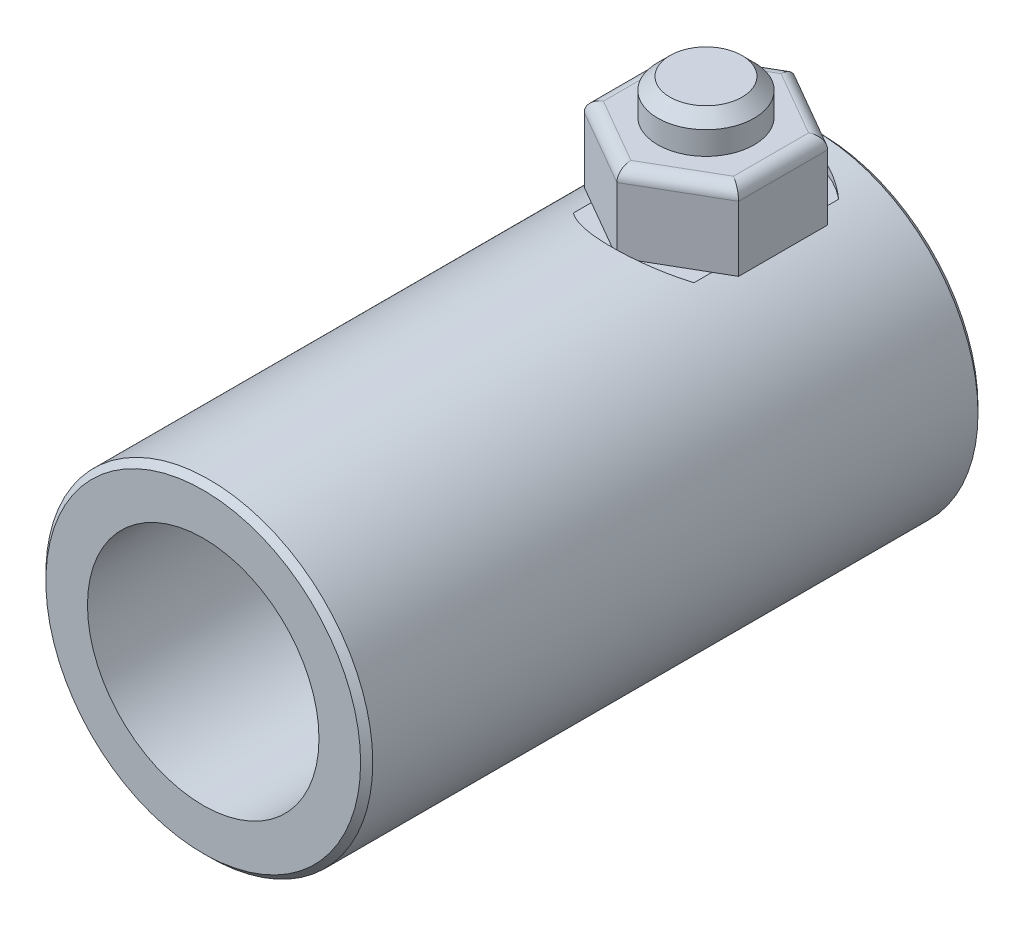
ISO-10303-21;
HEADER;
FILE_DESCRIPTION(('STEP AP214'),'2;1');
FILE_NAME('part.step','',(''),(''),'','','');
FILE_SCHEMA(('AUTOMOTIVE_DESIGN { 1 0 10303 214 1 1 1 1 }'));
ENDSEC;
DATA;
#1=APPLICATION_CONTEXT('core data for automotive mechanical design processes');
#2=APPLICATION_PROTOCOL_DEFINITION('international standard','automotive_design',2000,#1);
#3=PRODUCT_CONTEXT('',#1,'mechanical');
#4=PRODUCT('Part','Part','',(#3));
#5=PRODUCT_RELATED_PRODUCT_CATEGORY('part','',(#4));
#6=PRODUCT_DEFINITION_FORMATION('','',#4);
#7=PRODUCT_DEFINITION_CONTEXT('part definition',#1,'design');
#8=PRODUCT_DEFINITION('design','',#6,#7);
#9=PRODUCT_DEFINITION_SHAPE('','',#8);
#10=(LENGTH_UNIT() NAMED_UNIT(*) SI_UNIT(.MILLI.,.METRE.));
#11=(NAMED_UNIT(*) PLANE_ANGLE_UNIT() SI_UNIT($,.RADIAN.));
#12=(NAMED_UNIT(*) SI_UNIT($,.STERADIAN.) SOLID_ANGLE_UNIT());
#13=UNCERTAINTY_MEASURE_WITH_UNIT(LENGTH_MEASURE(1.E-05),#10,'distance_accuracy_value','');
#14=(GEOMETRIC_REPRESENTATION_CONTEXT(3) GLOBAL_UNCERTAINTY_ASSIGNED_CONTEXT((#13)) GLOBAL_UNIT_ASSIGNED_CONTEXT((#10,
#11,#12)) REPRESENTATION_CONTEXT('',''));
#15=CARTESIAN_POINT('',(0.,0.,0.));
#16=DIRECTION('',(0.,0.,1.));
#17=DIRECTION('',(1.,0.,0.));
#18=AXIS2_PLACEMENT_3D('',#15,#16,#17);
#19=CARTESIAN_POINT('',(0.,18.85,-8.63640158129175));
#20=DIRECTION('',(-0.5,0.,-0.866025403784439));
#21=DIRECTION('',(-0.866025403784439,0.,0.5));
#22=AXIS2_PLACEMENT_3D('',#19,#20,#21);
#23=PLANE('',#22);
#24=DIRECTION('',(0.,-1.,0.));
#25=VECTOR('',#24,1.);
#26=CARTESIAN_POINT('',(6.35,18.85,-12.3025757906459));
#27=LINE('',#26,#25);
#28=CARTESIAN_POINT('',(6.35,17.85,-12.3025757906459));
#29=VERTEX_POINT('',#28);
#30=CARTESIAN_POINT('',(6.35,12.5,-12.3025757906459));
#31=VERTEX_POINT('',#30);
#32=EDGE_CURVE('E114',#29,#31,#27,.T.);
#33=ORIENTED_EDGE('',*,*,#32,.F.);
#34=DIRECTION('',(0.866025403784439,0.,-0.5));
#35=VECTOR('',#34,1.);
#36=CARTESIAN_POINT('',(0.,17.85,-8.63640158129175));
#37=LINE('',#36,#35);
#38=CARTESIAN_POINT('',(0.,17.85,-8.63640158129175));
#39=VERTEX_POINT('',#38);
#40=EDGE_CURVE('E12',#29,#39,#37,.F.);
#41=ORIENTED_EDGE('',*,*,#40,.T.);
#42=DIRECTION('',(0.,-1.,0.));
#43=VECTOR('',#42,1.);
#44=CARTESIAN_POINT('',(0.,18.85,-8.63640158129175));
#45=LINE('',#44,#43);
#46=CARTESIAN_POINT('',(0.,12.5,-8.63640158129175));
#47=VERTEX_POINT('',#46);
#48=EDGE_CURVE('E135',#39,#47,#45,.T.);
#49=ORIENTED_EDGE('',*,*,#48,.T.);
#50=DIRECTION('',(0.866025403784439,0.,-0.5));
#51=VECTOR('',#50,1.);
#52=CARTESIAN_POINT('',(0.,12.5,-8.63640158129175));
#53=LINE('',#52,#51);
#54=EDGE_CURVE('E129',#47,#31,#53,.T.);
#55=ORIENTED_EDGE('',*,*,#54,.T.);
#56=EDGE_LOOP('',(#33,#41,#49,#55));
#57=FACE_BOUND('',#56,.T.);
#58=ADVANCED_FACE('F44',(#57),#23,.F.);
#59=CARTESIAN_POINT('',(6.35,18.85,-12.3025757906459));
#60=DIRECTION('',(-1.,0.,0.));
#61=DIRECTION('',(0.,0.,1.));
#62=AXIS2_PLACEMENT_3D('',#59,#60,#61);
#63=PLANE('',#62);
#64=DIRECTION('',(0.,-1.,0.));
#65=VECTOR('',#64,1.);
#66=CARTESIAN_POINT('',(6.35,18.85,-19.6349242093541));
#67=LINE('',#66,#65);
#68=CARTESIAN_POINT('',(6.35,17.85,-19.6349242093541));
#69=VERTEX_POINT('',#68);
#70=CARTESIAN_POINT('',(6.35,12.5,-19.6349242093541));
#71=VERTEX_POINT('',#70);
#72=EDGE_CURVE('E123',#69,#71,#67,.T.);
#73=ORIENTED_EDGE('',*,*,#72,.F.);
#74=DIRECTION('',(0.,0.,-1.));
#75=VECTOR('',#74,1.);
#76=CARTESIAN_POINT('',(6.35,17.85,-12.3025757906459));
#77=LINE('',#76,#75);
#78=EDGE_CURVE('E53',#69,#29,#77,.F.);
#79=ORIENTED_EDGE('',*,*,#78,.T.);
#80=ORIENTED_EDGE('',*,*,#32,.T.);
#81=DIRECTION('',(0.,0.,-1.));
#82=VECTOR('',#81,1.);
#83=CARTESIAN_POINT('',(6.35,12.5,-12.3025757906459));
#84=LINE('',#83,#82);
#85=EDGE_CURVE('E117',#31,#71,#84,.T.);
#86=ORIENTED_EDGE('',*,*,#85,.T.);
#87=EDGE_LOOP('',(#73,#79,#80,#86));
#88=FACE_BOUND('',#87,.T.);
#89=ADVANCED_FACE('F116',(#88),#63,.F.);
#90=CARTESIAN_POINT('',(6.35,18.85,-19.6349242093541));
#91=DIRECTION('',(-0.5,0.,0.866025403784438));
#92=DIRECTION('',(0.866025403784438,0.,0.500000000000001));
#93=AXIS2_PLACEMENT_3D('',#90,#91,#92);
#94=PLANE('',#93);
#95=DIRECTION('',(0.,-1.,0.));
#96=VECTOR('',#95,1.);
#97=CARTESIAN_POINT('',(0.,18.85,-23.3010984187082));
#98=LINE('',#97,#96);
#99=CARTESIAN_POINT('',(0.,17.85,-23.3010984187082));
#100=VERTEX_POINT('',#99);
#101=CARTESIAN_POINT('',(0.,12.5,-23.3010984187082));
#102=VERTEX_POINT('',#101);
#103=EDGE_CURVE('E155',#100,#102,#98,.T.);
#104=ORIENTED_EDGE('',*,*,#103,.F.);
#105=DIRECTION('',(-0.866025403784438,0.,-0.500000000000001));
#106=VECTOR('',#105,1.);
#107=CARTESIAN_POINT('',(6.35,17.85,-19.6349242093541));
#108=LINE('',#107,#106);
#109=EDGE_CURVE('E68',#100,#69,#108,.F.);
#110=ORIENTED_EDGE('',*,*,#109,.T.);
#111=ORIENTED_EDGE('',*,*,#72,.T.);
#112=DIRECTION('',(-0.866025403784438,0.,-0.500000000000001));
#113=VECTOR('',#112,1.);
#114=CARTESIAN_POINT('',(6.35,12.5,-19.6349242093541));
#115=LINE('',#114,#113);
#116=EDGE_CURVE('E132',#71,#102,#115,.T.);
#117=ORIENTED_EDGE('',*,*,#116,.T.);
#118=EDGE_LOOP('',(#104,#110,#111,#117));
#119=FACE_BOUND('',#118,.T.);
#120=ADVANCED_FACE('F237',(#119),#94,.F.);
#121=CARTESIAN_POINT('',(0.,18.85,-23.3010984187082));
#122=DIRECTION('',(0.5,0.,0.866025403784439));
#123=DIRECTION('',(0.866025403784439,0.,-0.5));
#124=AXIS2_PLACEMENT_3D('',#121,#122,#123);
#125=PLANE('',#124);
#126=DIRECTION('',(0.,-1.,0.));
#127=VECTOR('',#126,1.);
#128=CARTESIAN_POINT('',(-6.35,18.85,-19.6349242093541));
#129=LINE('',#128,#127);
#130=CARTESIAN_POINT('',(-6.35,17.85,-19.6349242093541));
#131=VERTEX_POINT('',#130);
#132=CARTESIAN_POINT('',(-6.35,12.5,-19.6349242093541));
#133=VERTEX_POINT('',#132);
#134=EDGE_CURVE('E153',#131,#133,#129,.T.);
#135=ORIENTED_EDGE('',*,*,#134,.F.);
#136=DIRECTION('',(-0.866025403784439,0.,0.5));
#137=VECTOR('',#136,1.);
#138=CARTESIAN_POINT('',(0.,17.85,-23.3010984187082));
#139=LINE('',#138,#137);
#140=EDGE_CURVE('E175',#131,#100,#139,.F.);
#141=ORIENTED_EDGE('',*,*,#140,.T.);
#142=ORIENTED_EDGE('',*,*,#103,.T.);
#143=DIRECTION('',(-0.866025403784439,0.,0.5));
#144=VECTOR('',#143,1.);
#145=CARTESIAN_POINT('',(0.,12.5,-23.3010984187082));
#146=LINE('',#145,#144);
#147=EDGE_CURVE('E142',#102,#133,#146,.T.);
#148=ORIENTED_EDGE('',*,*,#147,.T.);
#149=EDGE_LOOP('',(#135,#141,#142,#148));
#150=FACE_BOUND('',#149,.T.);
#151=ADVANCED_FACE('F222',(#150),#125,.F.);
#152=CARTESIAN_POINT('',(-6.35,18.85,-19.6349242093541));
#153=DIRECTION('',(1.,0.,0.));
#154=DIRECTION('',(0.,0.,-1.));
#155=AXIS2_PLACEMENT_3D('',#152,#153,#154);
#156=PLANE('',#155);
#157=DIRECTION('',(0.,-1.,0.));
#158=VECTOR('',#157,1.);
#159=CARTESIAN_POINT('',(-6.35,18.85,-12.3025757906459));
#160=LINE('',#159,#158);
#161=CARTESIAN_POINT('',(-6.35,17.85,-12.3025757906459));
#162=VERTEX_POINT('',#161);
#163=CARTESIAN_POINT('',(-6.35,12.5,-12.3025757906459));
#164=VERTEX_POINT('',#163);
#165=EDGE_CURVE('E151',#162,#164,#160,.T.);
#166=ORIENTED_EDGE('',*,*,#165,.F.);
#167=DIRECTION('',(0.,0.,1.));
#168=VECTOR('',#167,1.);
#169=CARTESIAN_POINT('',(-6.35,17.85,-19.6349242093541));
#170=LINE('',#169,#168);
#171=EDGE_CURVE('E173',#162,#131,#170,.F.);
#172=ORIENTED_EDGE('',*,*,#171,.T.);
#173=ORIENTED_EDGE('',*,*,#134,.T.);
#174=DIRECTION('',(0.,0.,1.));
#175=VECTOR('',#174,1.);
#176=CARTESIAN_POINT('',(-6.35,12.5,-19.6349242093541));
#177=LINE('',#176,#175);
#178=EDGE_CURVE('E145',#133,#164,#177,.T.);
#179=ORIENTED_EDGE('',*,*,#178,.T.);
#180=EDGE_LOOP('',(#166,#172,#173,#179));
#181=FACE_BOUND('',#180,.T.);
#182=ADVANCED_FACE('F219',(#181),#156,.F.);
#183=CARTESIAN_POINT('',(-6.35,18.85,-12.3025757906459));
#184=DIRECTION('',(0.5,0.,-0.866025403784438));
#185=DIRECTION('',(-0.866025403784439,0.,-0.5));
#186=AXIS2_PLACEMENT_3D('',#183,#184,#185);
#187=PLANE('',#186);
#188=ORIENTED_EDGE('',*,*,#48,.F.);
#189=DIRECTION('',(0.866025403784439,0.,0.5));
#190=VECTOR('',#189,1.);
#191=CARTESIAN_POINT('',(-6.35,17.85,-12.3025757906459));
#192=LINE('',#191,#190);
#193=EDGE_CURVE('E170',#39,#162,#192,.F.);
#194=ORIENTED_EDGE('',*,*,#193,.T.);
#195=ORIENTED_EDGE('',*,*,#165,.T.);
#196=DIRECTION('',(0.866025403784439,0.,0.5));
#197=VECTOR('',#196,1.);
#198=CARTESIAN_POINT('',(-6.35,12.5,-12.3025757906459));
#199=LINE('',#198,#197);
#200=EDGE_CURVE('E148',#164,#47,#199,.T.);
#201=ORIENTED_EDGE('',*,*,#200,.T.);
#202=EDGE_LOOP('',(#188,#194,#195,#201));
#203=FACE_BOUND('',#202,.T.);
#204=ADVANCED_FACE('F208',(#203),#187,.F.);
#205=CARTESIAN_POINT('',(0.,18.85,0.));
#206=DIRECTION('',(0.,1.,0.));
#207=DIRECTION('',(0.,0.,1.));
#208=AXIS2_PLACEMENT_3D('',#205,#206,#207);
#209=PLANE('',#208);
#210=DIRECTION('',(0.,0.,1.));
#211=VECTOR('',#210,1.);
#212=CARTESIAN_POINT('',(-5.35,18.85,-12.3025757906459));
#213=LINE('',#212,#211);
#214=CARTESIAN_POINT('',(-5.35,18.85,-19.0575739401645));
#215=VERTEX_POINT('',#214);
#216=CARTESIAN_POINT('',(-5.35,18.85,-12.8799260598355));
#217=VERTEX_POINT('',#216);
#218=EDGE_CURVE('E165',#215,#217,#213,.T.);
#219=ORIENTED_EDGE('',*,*,#218,.T.);
#220=DIRECTION('',(0.866025403784439,0.,0.5));
#221=VECTOR('',#220,1.);
#222=CARTESIAN_POINT('',(0.499999999999994,18.85,-9.50242698507619));
#223=LINE('',#222,#221);
#224=CARTESIAN_POINT('',(0.,18.85,-9.791102119671));
#225=VERTEX_POINT('',#224);
#226=EDGE_CURVE('E167',#217,#225,#223,.T.);
#227=ORIENTED_EDGE('',*,*,#226,.T.);
#228=DIRECTION('',(0.866025403784439,0.,-0.5));
#229=VECTOR('',#228,1.);
#230=CARTESIAN_POINT('',(5.85,18.85,-13.1686011944303));
#231=LINE('',#230,#229);
#232=CARTESIAN_POINT('',(5.35,18.85,-12.8799260598355));
#233=VERTEX_POINT('',#232);
#234=EDGE_CURVE('E122',#225,#233,#231,.T.);
#235=ORIENTED_EDGE('',*,*,#234,.T.);
#236=DIRECTION('',(0.,0.,-1.));
#237=VECTOR('',#236,1.);
#238=CARTESIAN_POINT('',(5.35,18.85,-19.6349242093541));
#239=LINE('',#238,#237);
#240=CARTESIAN_POINT('',(5.35,18.85,-19.0575739401645));
#241=VERTEX_POINT('',#240);
#242=EDGE_CURVE('E159',#233,#241,#239,.T.);
#243=ORIENTED_EDGE('',*,*,#242,.T.);
#244=DIRECTION('',(-0.866025403784438,0.,-0.500000000000001));
#245=VECTOR('',#244,1.);
#246=CARTESIAN_POINT('',(-0.500000000000004,18.85,-22.4350730149238));
#247=LINE('',#246,#245);
#248=CARTESIAN_POINT('',(0.,18.85,-22.146397880329));
#249=VERTEX_POINT('',#248);
#250=EDGE_CURVE('E161',#241,#249,#247,.T.);
#251=ORIENTED_EDGE('',*,*,#250,.T.);
#252=DIRECTION('',(-0.866025403784439,0.,0.5));
#253=VECTOR('',#252,1.);
#254=CARTESIAN_POINT('',(-5.85,18.85,-18.7688988055697));
#255=LINE('',#254,#253);
#256=EDGE_CURVE('E163',#249,#215,#255,.T.);
#257=ORIENTED_EDGE('',*,*,#256,.T.);
#258=EDGE_LOOP('',(#219,#227,#235,#243,#251,#257));
#259=FACE_BOUND('',#258,.T.);
#260=ADVANCED_FACE('F198',(#259),#209,.T.);
#261=CARTESIAN_POINT('',(0.,12.5,0.));
#262=DIRECTION('',(0.,1.,0.));
#263=DIRECTION('',(0.,0.,1.));
#264=AXIS2_PLACEMENT_3D('',#261,#262,#263);
#265=PLANE('',#264);
#266=ORIENTED_EDGE('',*,*,#54,.F.);
#267=ORIENTED_EDGE('',*,*,#200,.F.);
#268=ORIENTED_EDGE('',*,*,#178,.F.);
#269=ORIENTED_EDGE('',*,*,#147,.F.);
#270=ORIENTED_EDGE('',*,*,#116,.F.);
#271=ORIENTED_EDGE('',*,*,#85,.F.);
#272=EDGE_LOOP('',(#266,#267,#268,#269,#270,#271));
#273=FACE_BOUND('',#272,.T.);
#274=ADVANCED_FACE('F127',(#273),#265,.F.);
#275=CARTESIAN_POINT('',(9.58967158334138,17.85,-16.6097984102467));
#276=DIRECTION('',(0.866025403784438,0.,0.500000000000001));
#277=DIRECTION('',(0.500000000000001,0.,-0.866025403784438));
#278=AXIS2_PLACEMENT_3D('',#275,#276,#277);
#279=CYLINDRICAL_SURFACE('',#278,1.);
#280=CARTESIAN_POINT('',(5.35,17.85,-19.0575739401645));
#281=DIRECTION('',(0.5,0.,0.866025403784439));
#282=DIRECTION('',(-0.866025403784439,0.,0.5));
#283=AXIS2_PLACEMENT_3D('',#280,#281,#282);
#284=ELLIPSE('',#283,1.15470053837925,1.);
#285=EDGE_CURVE('E139',#69,#241,#284,.T.);
#286=ORIENTED_EDGE('',*,*,#285,.F.);
#287=ORIENTED_EDGE('',*,*,#109,.F.);
#288=CARTESIAN_POINT('',(0.,17.85,-22.146397880329));
#289=DIRECTION('',(1.,0.,0.));
#290=DIRECTION('',(0.,0.,1.));
#291=AXIS2_PLACEMENT_3D('',#288,#289,#290);
#292=ELLIPSE('',#291,1.15470053837925,1.);
#293=EDGE_CURVE('E48',#249,#100,#292,.F.);
#294=ORIENTED_EDGE('',*,*,#293,.F.);
#295=ORIENTED_EDGE('',*,*,#250,.F.);
#296=EDGE_LOOP('',(#286,#287,#294,#295));
#297=FACE_BOUND('',#296,.T.);
#298=ADVANCED_FACE('F46',(#297),#279,.T.);
#299=CARTESIAN_POINT('',(-9.58967158334138,17.85,-16.6097984102467));
#300=DIRECTION('',(0.866025403784439,0.,-0.5));
#301=DIRECTION('',(-0.5,0.,-0.866025403784439));
#302=AXIS2_PLACEMENT_3D('',#299,#300,#301);
#303=CYLINDRICAL_SURFACE('',#302,1.);
#304=ORIENTED_EDGE('',*,*,#293,.T.);
#305=ORIENTED_EDGE('',*,*,#140,.F.);
#306=CARTESIAN_POINT('',(-5.35,17.85,-19.0575739401645));
#307=DIRECTION('',(0.5,0.,-0.866025403784439));
#308=DIRECTION('',(0.866025403784439,0.,0.5));
#309=AXIS2_PLACEMENT_3D('',#306,#307,#308);
#310=ELLIPSE('',#309,1.15470053837925,1.);
#311=EDGE_CURVE('E186',#215,#131,#310,.F.);
#312=ORIENTED_EDGE('',*,*,#311,.F.);
#313=ORIENTED_EDGE('',*,*,#256,.F.);
#314=EDGE_LOOP('',(#304,#305,#312,#313));
#315=FACE_BOUND('',#314,.T.);
#316=ADVANCED_FACE('F225',(#315),#303,.T.);
#317=CARTESIAN_POINT('',(5.35,17.85,0.));
#318=DIRECTION('',(0.,0.,1.));
#319=DIRECTION('',(1.,0.,0.));
#320=AXIS2_PLACEMENT_3D('',#317,#318,#319);
#321=CYLINDRICAL_SURFACE('',#320,1.);
#322=ORIENTED_EDGE('',*,*,#285,.T.);
#323=ORIENTED_EDGE('',*,*,#242,.F.);
#324=CARTESIAN_POINT('',(5.35,17.85,-12.8799260598355));
#325=DIRECTION('',(-0.5,0.,0.866025403784439));
#326=DIRECTION('',(-0.866025403784439,0.,-0.5));
#327=AXIS2_PLACEMENT_3D('',#324,#325,#326);
#328=ELLIPSE('',#327,1.15470053837925,1.);
#329=EDGE_CURVE('E183',#29,#233,#328,.T.);
#330=ORIENTED_EDGE('',*,*,#329,.F.);
#331=ORIENTED_EDGE('',*,*,#78,.F.);
#332=EDGE_LOOP('',(#322,#323,#330,#331));
#333=FACE_BOUND('',#332,.T.);
#334=ADVANCED_FACE('F192',(#333),#321,.T.);
#335=CARTESIAN_POINT('',(-5.35,17.85,0.));
#336=DIRECTION('',(0.,0.,-1.));
#337=DIRECTION('',(-1.,0.,0.));
#338=AXIS2_PLACEMENT_3D('',#335,#336,#337);
#339=CYLINDRICAL_SURFACE('',#338,1.);
#340=ORIENTED_EDGE('',*,*,#311,.T.);
#341=ORIENTED_EDGE('',*,*,#171,.F.);
#342=CARTESIAN_POINT('',(-5.35,17.85,-12.8799260598355));
#343=DIRECTION('',(-0.5,0.,-0.866025403784439));
#344=DIRECTION('',(0.866025403784439,0.,-0.5));
#345=AXIS2_PLACEMENT_3D('',#342,#343,#344);
#346=ELLIPSE('',#345,1.15470053837925,1.);
#347=EDGE_CURVE('E181',#217,#162,#346,.F.);
#348=ORIENTED_EDGE('',*,*,#347,.F.);
#349=ORIENTED_EDGE('',*,*,#218,.F.);
#350=EDGE_LOOP('',(#340,#341,#348,#349));
#351=FACE_BOUND('',#350,.T.);
#352=ADVANCED_FACE('F216',(#351),#339,.T.);
#353=CARTESIAN_POINT('',(-4.23967158334137,17.85,-7.34332658975325));
#354=DIRECTION('',(-0.866025403784439,0.,0.5));
#355=DIRECTION('',(0.5,0.,0.866025403784439));
#356=AXIS2_PLACEMENT_3D('',#353,#354,#355);
#357=CYLINDRICAL_SURFACE('',#356,1.);
#358=ORIENTED_EDGE('',*,*,#329,.T.);
#359=ORIENTED_EDGE('',*,*,#234,.F.);
#360=CARTESIAN_POINT('',(0.,17.85,-9.791102119671));
#361=DIRECTION('',(-1.,0.,0.));
#362=DIRECTION('',(0.,0.,1.));
#363=AXIS2_PLACEMENT_3D('',#360,#361,#362);
#364=ELLIPSE('',#363,1.15470053837925,1.);
#365=EDGE_CURVE('E179',#39,#225,#364,.T.);
#366=ORIENTED_EDGE('',*,*,#365,.F.);
#367=ORIENTED_EDGE('',*,*,#40,.F.);
#368=EDGE_LOOP('',(#358,#359,#366,#367));
#369=FACE_BOUND('',#368,.T.);
#370=ADVANCED_FACE('F204',(#369),#357,.T.);
#371=CARTESIAN_POINT('',(4.23967158334137,17.85,-7.34332658975325));
#372=DIRECTION('',(-0.866025403784439,0.,-0.5));
#373=DIRECTION('',(-0.5,0.,0.866025403784439));
#374=AXIS2_PLACEMENT_3D('',#371,#372,#373);
#375=CYLINDRICAL_SURFACE('',#374,1.);
#376=ORIENTED_EDGE('',*,*,#347,.T.);
#377=ORIENTED_EDGE('',*,*,#193,.F.);
#378=ORIENTED_EDGE('',*,*,#365,.T.);
#379=ORIENTED_EDGE('',*,*,#226,.F.);
#380=EDGE_LOOP('',(#376,#377,#378,#379));
#381=FACE_BOUND('',#380,.T.);
#382=ADVANCED_FACE('F211',(#381),#375,.T.);
#383=CLOSED_SHELL('',(#58,#89,#120,#151,#182,#204,#260,#274,#298,#316,#334,#352,#370,#382));
#384=MANIFOLD_SOLID_BREP('B2',#383);
#385=CARTESIAN_POINT('',(0.,0.,-25.4));
#386=DIRECTION('',(0.,0.,1.));
#387=DIRECTION('',(1.,0.,0.));
#388=AXIS2_PLACEMENT_3D('',#385,#386,#387);
#389=CYLINDRICAL_SURFACE('',#388,13.45);
#390=CARTESIAN_POINT('',(0.,0.,-24.9));
#391=DIRECTION('',(0.,0.,1.));
#392=DIRECTION('',(1.,0.,0.));
#393=AXIS2_PLACEMENT_3D('',#390,#391,#392);
#394=CIRCLE('',#393,13.45);
#395=CARTESIAN_POINT('',(13.45,0.,-24.9));
#396=VERTEX_POINT('',#395);
#397=EDGE_CURVE('E464',#396,#396,#394,.T.);
#398=ORIENTED_EDGE('',*,*,#397,.T.);
#399=EDGE_LOOP('',(#398));
#400=FACE_BOUND('',#399,.T.);
#401=CARTESIAN_POINT('',(0.,0.,24.9));
#402=DIRECTION('',(0.,0.,1.));
#403=DIRECTION('',(1.,0.,0.));
#404=AXIS2_PLACEMENT_3D('',#401,#402,#403);
#405=CIRCLE('',#404,13.45);
#406=CARTESIAN_POINT('',(13.45,0.,24.9));
#407=VERTEX_POINT('',#406);
#408=EDGE_CURVE('E467',#407,#407,#405,.F.);
#409=ORIENTED_EDGE('',*,*,#408,.T.);
#410=EDGE_LOOP('',(#409));
#411=FACE_BOUND('',#410,.T.);
#412=DIRECTION('',(0.,0.,1.));
#413=VECTOR('',#412,1.);
#414=CARTESIAN_POINT('',(4.96512839713133,12.5,-25.4));
#415=LINE('',#414,#413);
#416=CARTESIAN_POINT('',(4.96512839713133,12.5,-21.9193802187247));
#417=VERTEX_POINT('',#416);
#418=CARTESIAN_POINT('',(4.96512839713133,12.5,-10.0181197812753));
#419=VERTEX_POINT('',#418);
#420=EDGE_CURVE('E377',#417,#419,#415,.T.);
#421=ORIENTED_EDGE('',*,*,#420,.T.);
#422=CARTESIAN_POINT('',(4.96512839713133,12.5,-10.0181197812753));
#423=CARTESIAN_POINT('',(4.80890370648286,12.5620709984683,-9.88776431651455));
#424=CARTESIAN_POINT('',(4.64721709085685,12.6228872352284,-9.76329497385361));
#425=CARTESIAN_POINT('',(4.31351034013302,12.7407750355861,-9.5268589045999));
#426=CARTESIAN_POINT('',(4.14148416525046,12.7978443689229,-9.41489959699462));
#427=CARTESIAN_POINT('',(3.78706519568577,12.9071766573318,-9.20388778249606));
#428=CARTESIAN_POINT('',(3.60462854974069,12.9594164138213,-9.10489670656277));
#429=CARTESIAN_POINT('',(3.23103794567395,13.0575715665244,-8.92132500684903));
#430=CARTESIAN_POINT('',(3.0398855531962,13.1034880926936,-8.83674180775212));
#431=CARTESIAN_POINT('',(2.6491119865171,13.1880563204959,-8.68252987882194));
#432=CARTESIAN_POINT('',(2.44945896263611,13.2266770863563,-8.6129646584841));
#433=CARTESIAN_POINT('',(2.04375840011669,13.2954080075868,-8.49008227675673));
#434=CARTESIAN_POINT('',(1.8377105262045,13.3255177158938,-8.43676596886774));
#435=CARTESIAN_POINT('',(1.42132767861589,13.3763299780457,-8.34723046681733));
#436=CARTESIAN_POINT('',(1.21100465011175,13.3970557564356,-8.31096905429377));
#437=CARTESIAN_POINT('',(0.787359380846856,13.428613689135,-8.25589201291469));
#438=CARTESIAN_POINT('',(0.574037453204534,13.4394468686652,-8.23707457624761));
#439=CARTESIAN_POINT('',(0.164260608157366,13.4504254845834,-8.21800840517001));
#440=CARTESIAN_POINT('',(-0.0321076079475703,13.4513914713028,-8.21633403286658));
#441=CARTESIAN_POINT('',(-0.424252776115725,13.4447371571926,-8.22788564305689));
#442=CARTESIAN_POINT('',(-0.620029758159426,13.4371172993243,-8.24111085685075));
#443=CARTESIAN_POINT('',(-1.00962909127787,13.4134732353794,-8.28229779612236));
#444=CARTESIAN_POINT('',(-1.2034501746999,13.3974438959982,-8.31026852258727));
#445=CARTESIAN_POINT('',(-1.58761328136511,13.3573680970674,-8.38059365839724));
#446=CARTESIAN_POINT('',(-1.77795533631538,13.3333217106218,-8.42294793658482));
#447=CARTESIAN_POINT('',(-2.14857876716113,13.2785620670281,-8.52014111610754));
#448=CARTESIAN_POINT('',(-2.32899247689527,13.2480560531234,-8.57459405635841));
#449=CARTESIAN_POINT('',(-2.68438198034741,13.1806419200975,-8.69607000131531));
#450=CARTESIAN_POINT('',(-2.85935551422715,13.143731181281,-8.76309815051606));
#451=CARTESIAN_POINT('',(-3.20281917820984,13.0642835855723,-8.90905789886895));
#452=CARTESIAN_POINT('',(-3.37131262468557,13.0217496573348,-8.9879833047029));
#453=CARTESIAN_POINT('',(-3.70119567564656,12.9318556094599,-9.15714103542994));
#454=CARTESIAN_POINT('',(-3.86258453221449,12.8844949834358,-9.24737454692652));
#455=CARTESIAN_POINT('',(-4.18686578994507,12.7829248428343,-9.44412732952227));
#456=CARTESIAN_POINT('',(-4.349291865353,12.7284766007,-9.55129116346696));
#457=CARTESIAN_POINT('',(-4.66446980043698,12.616386791584,-9.77660531846988));
#458=CARTESIAN_POINT('',(-4.8172463484752,12.5587541453153,-9.89472552048206));
#459=CARTESIAN_POINT('',(-4.96512839713133,12.5,-10.0181197812753));
#460=B_SPLINE_CURVE_WITH_KNOTS('',3,(#422,#423,#424,#425,#426,#427,#428,#429,#430,#431,#432,
#433,#434,#435,#436,#437,#438,#439,#440,#441,#442,#443,#444,#445,#446,#447,#448,#449,#450,#451,
#452,#453,#454,#455,#456,#457,#458,#459),.UNSPECIFIED.,.F.,.F.,(4,2,2,2,2,2,2,2,2,2,2,2,2,2,2,2,
2,2,4),(0.,0.638075460045657,1.27652734003317,1.91790192321045,2.55916174418366,
3.20308245402837,3.84703698102778,4.48938893678638,5.1316743147672,5.72006429499968,
6.30842392038952,6.89714311008225,7.48585693163902,8.05796059702424,8.63029882134229,
9.20234012770385,9.77444151092405,10.3800756110418,10.9840915591554),.UNSPECIFIED.);
#461=CARTESIAN_POINT('',(-4.96512839713133,12.5,-10.0181197812753));
#462=VERTEX_POINT('',#461);
#463=EDGE_CURVE('E368',#419,#462,#460,.T.);
#464=ORIENTED_EDGE('',*,*,#463,.T.);
#465=DIRECTION('',(0.,0.,1.));
#466=VECTOR('',#465,1.);
#467=CARTESIAN_POINT('',(-4.96512839713133,12.5,-25.4));
#468=LINE('',#467,#466);
#469=CARTESIAN_POINT('',(-4.96512839713133,12.5,-21.9193802187247));
#470=VERTEX_POINT('',#469);
#471=EDGE_CURVE('E360',#462,#470,#468,.F.);
#472=ORIENTED_EDGE('',*,*,#471,.T.);
#473=CARTESIAN_POINT('',(-4.96512839713133,12.5,-21.9193802187247));
#474=CARTESIAN_POINT('',(-4.80890370648286,12.5620709984683,-22.0497356834854));
#475=CARTESIAN_POINT('',(-4.64721709085685,12.6228872352285,-22.1742050261464));
#476=CARTESIAN_POINT('',(-4.31351034013302,12.7407750355861,-22.4106410954001));
#477=CARTESIAN_POINT('',(-4.14148416525045,12.7978443689229,-22.5226004030054));
#478=CARTESIAN_POINT('',(-3.78706519568577,12.9071766573318,-22.7336122175039));
#479=CARTESIAN_POINT('',(-3.60462854974069,12.9594164138213,-22.8326032934372));
#480=CARTESIAN_POINT('',(-3.23103794567395,13.0575715665244,-23.016174993151));
#481=CARTESIAN_POINT('',(-3.0398855531962,13.1034880926936,-23.1007581922479));
#482=CARTESIAN_POINT('',(-2.64911198651709,13.1880563204959,-23.2549701211781));
#483=CARTESIAN_POINT('',(-2.44945896263611,13.2266770863563,-23.3245353415159));
#484=CARTESIAN_POINT('',(-2.04375840011669,13.2954080075868,-23.4474177232433));
#485=CARTESIAN_POINT('',(-1.8377105262045,13.3255177158938,-23.5007340311323));
#486=CARTESIAN_POINT('',(-1.42132767861589,13.3763299780457,-23.5902695331827));
#487=CARTESIAN_POINT('',(-1.21100465011175,13.3970557564356,-23.6265309457062));
#488=CARTESIAN_POINT('',(-0.787359380846855,13.428613689135,-23.6816079870853));
#489=CARTESIAN_POINT('',(-0.574037453204533,13.4394468686652,-23.7004254237524));
#490=CARTESIAN_POINT('',(-0.164260608157364,13.4504254845834,-23.71949159483));
#491=CARTESIAN_POINT('',(0.0321076079475721,13.4513914713028,-23.7211659671334));
#492=CARTESIAN_POINT('',(0.424252776115727,13.4447371571926,-23.7096143569431));
#493=CARTESIAN_POINT('',(0.620029758159429,13.4371172993243,-23.6963891431492));
#494=CARTESIAN_POINT('',(1.00962909127787,13.4134732353794,-23.6552022038776));
#495=CARTESIAN_POINT('',(1.2034501746999,13.3974438959982,-23.6272314774127));
#496=CARTESIAN_POINT('',(1.58761328136511,13.3573680970674,-23.5569063416027));
#497=CARTESIAN_POINT('',(1.77795533631538,13.3333217106218,-23.5145520634152));
#498=CARTESIAN_POINT('',(2.14857876716113,13.2785620670281,-23.4173588838925));
#499=CARTESIAN_POINT('',(2.32899247689528,13.2480560531234,-23.3629059436416));
#500=CARTESIAN_POINT('',(2.68438198034742,13.1806419200975,-23.2414299986847));
#501=CARTESIAN_POINT('',(2.85935551422716,13.143731181281,-23.1744018494839));
#502=CARTESIAN_POINT('',(3.20281917820985,13.0642835855723,-23.028442101131));
#503=CARTESIAN_POINT('',(3.37131262468557,13.0217496573348,-22.9495166952971));
#504=CARTESIAN_POINT('',(3.70119567564656,12.9318556094599,-22.78035896457));
#505=CARTESIAN_POINT('',(3.86258453221449,12.8844949834358,-22.6901254530735));
#506=CARTESIAN_POINT('',(4.18686578994507,12.7829248428343,-22.4933726704777));
#507=CARTESIAN_POINT('',(4.349291865353,12.7284766007,-22.386208836533));
#508=CARTESIAN_POINT('',(4.66446980043698,12.616386791584,-22.1608946815301));
#509=CARTESIAN_POINT('',(4.8172463484752,12.5587541453153,-22.0427744795179));
#510=CARTESIAN_POINT('',(4.96512839713133,12.5,-21.9193802187247));
#511=B_SPLINE_CURVE_WITH_KNOTS('',3,(#473,#474,#475,#476,#477,#478,#479,#480,#481,#482,#483,
#484,#485,#486,#487,#488,#489,#490,#491,#492,#493,#494,#495,#496,#497,#498,#499,#500,#501,#502,
#503,#504,#505,#506,#507,#508,#509,#510),.UNSPECIFIED.,.F.,.F.,(4,2,2,2,2,2,2,2,2,2,2,2,2,2,2,2,
2,2,4),(0.,0.638075460045657,1.27652734003317,1.91790192321044,2.55916174418366,
3.20308245402837,3.84703698102779,4.48938893678638,5.1316743147672,5.72006429499968,
6.30842392038952,6.89714311008226,7.48585693163903,8.05796059702425,8.63029882134229,
9.20234012770386,9.77444151092405,10.3800756110418,10.9840915591554),.UNSPECIFIED.);
#512=EDGE_CURVE('E381',#470,#417,#511,.T.);
#513=ORIENTED_EDGE('',*,*,#512,.T.);
#514=EDGE_LOOP('',(#421,#464,#472,#513));
#515=FACE_BOUND('',#514,.T.);
#516=ADVANCED_FACE('F339',(#400,#411,#515),#389,.T.);
#517=CARTESIAN_POINT('',(0.,0.,25.4));
#518=DIRECTION('',(0.,0.,-1.));
#519=DIRECTION('',(-1.,0.,0.));
#520=AXIS2_PLACEMENT_3D('',#517,#518,#519);
#521=CYLINDRICAL_SURFACE('',#520,7.9375);
#522=CARTESIAN_POINT('',(0.,0.,-25.4));
#523=DIRECTION('',(0.,0.,-1.));
#524=DIRECTION('',(-1.,0.,0.));
#525=AXIS2_PLACEMENT_3D('',#522,#523,#524);
#526=CIRCLE('',#525,7.9375);
#527=CARTESIAN_POINT('',(-7.9375,0.,-25.4));
#528=VERTEX_POINT('',#527);
#529=EDGE_CURVE('E437',#528,#528,#526,.T.);
#530=ORIENTED_EDGE('',*,*,#529,.T.);
#531=EDGE_LOOP('',(#530));
#532=FACE_BOUND('',#531,.T.);
#533=CARTESIAN_POINT('',(0.,0.,0.));
#534=DIRECTION('',(0.,0.,1.));
#535=DIRECTION('',(1.,0.,0.));
#536=AXIS2_PLACEMENT_3D('',#533,#534,#535);
#537=CIRCLE('',#536,7.9375);
#538=CARTESIAN_POINT('',(7.9375,0.,0.));
#539=VERTEX_POINT('',#538);
#540=EDGE_CURVE('E433',#539,#539,#537,.T.);
#541=ORIENTED_EDGE('',*,*,#540,.T.);
#542=EDGE_LOOP('',(#541));
#543=FACE_BOUND('',#542,.T.);
#544=CARTESIAN_POINT('',(0.,7.9375,-19.9375));
#545=CARTESIAN_POINT('',(0.104369410089828,7.93749964710061,-19.9374995983151));
#546=CARTESIAN_POINT('',(0.208746323529612,7.93543652404866,-19.9333779993824));
#547=CARTESIAN_POINT('',(0.416729911813044,7.9272367842324,-19.9169398131359));
#548=CARTESIAN_POINT('',(0.520336231742605,7.92109839537058,-19.9046196607396));
#549=CARTESIAN_POINT('',(0.726110731039584,7.90489272677887,-19.8719029971383));
#550=CARTESIAN_POINT('',(0.82827664337823,7.89481984439238,-19.851494968317));
#551=CARTESIAN_POINT('',(1.03030258640491,7.87100738632354,-19.8028430831276));
#552=CARTESIAN_POINT('',(1.13016165631416,7.8572663117564,-19.7745960234129));
#553=CARTESIAN_POINT('',(1.42440199017918,7.81115458867984,-19.6787888644378));
#554=CARTESIAN_POINT('',(1.61448373622076,7.77380867280489,-19.5999945424405));
#555=CARTESIAN_POINT('',(1.97834395847019,7.68928332519479,-19.4153225920459));
#556=CARTESIAN_POINT('',(2.15212371864541,7.64210466884468,-19.3094470990516));
#557=CARTESIAN_POINT('',(2.49041365625515,7.53888923529746,-19.0662900978896));
#558=CARTESIAN_POINT('',(2.65372701475933,7.48248923455529,-18.9274960984322));
#559=CARTESIAN_POINT('',(2.95584177494966,7.3683815511092,-18.6257535744267));
#560=CARTESIAN_POINT('',(3.09462449787671,7.31067290934779,-18.462786815793));
#561=CARTESIAN_POINT('',(3.3546096064078,7.19529548141557,-18.1019739737071));
#562=CARTESIAN_POINT('',(3.47361399641898,7.13797684614345,-17.9024030809149));
#563=CARTESIAN_POINT('',(3.62524200471708,7.06149696460579,-17.5880649486391));
#564=CARTESIAN_POINT('',(3.6713159275105,7.03758021096291,-17.4807498267466));
#565=CARTESIAN_POINT('',(3.7540313686651,6.99380755132026,-17.2617677865077));
#566=CARTESIAN_POINT('',(3.7906784717335,6.973949242426,-17.1501034900929));
#567=CARTESIAN_POINT('',(3.85217834905982,6.94015758970911,-16.9299869855321));
#568=CARTESIAN_POINT('',(3.8776017912118,6.92594266308114,-16.8217371466102));
#569=CARTESIAN_POINT('',(3.91931981478621,6.9024208871212,-16.6030152625144));
#570=CARTESIAN_POINT('',(3.93561923963159,6.89311143390609,-16.4925444286673));
#571=CARTESIAN_POINT('',(3.95884711357792,6.87979769947166,-16.2703689541391));
#572=CARTESIAN_POINT('',(3.96578120630086,6.87579022326954,-16.1586650974435));
#573=CARTESIAN_POINT('',(3.97018212403133,6.87325014427843,-15.9350151506959));
#574=CARTESIAN_POINT('',(3.9676498522986,6.87471701913886,-15.8230690847737));
#575=CARTESIAN_POINT('',(3.95403164408641,6.882557023164,-15.6133837807603));
#576=CARTESIAN_POINT('',(3.94400811209084,6.88832056579457,-15.5155510560495));
#577=CARTESIAN_POINT('',(3.91679667622581,6.90382839940708,-15.3211972285537));
#578=CARTESIAN_POINT('',(3.89960652217992,6.913573940638,-15.2246765475617));
#579=CARTESIAN_POINT('',(3.83755551593145,6.94833703678735,-14.9380863290756));
#580=CARTESIAN_POINT('',(3.78220441315265,6.97888716992628,-14.7508443511772));
#581=CARTESIAN_POINT('',(3.64414196450859,7.05197183776459,-14.384279810454));
#582=CARTESIAN_POINT('',(3.56082334971471,7.09476894900454,-14.2052433041467));
#583=CARTESIAN_POINT('',(3.36963314536098,7.18754170992462,-13.8628020800712));
#584=CARTESIAN_POINT('',(3.26175052720868,7.23752058029641,-13.6994044306856));
#585=CARTESIAN_POINT('',(3.00858289843046,7.34667673244783,-13.3711208908087));
#586=CARTESIAN_POINT('',(2.86028985758812,7.40621681108501,-13.2086733165628));
#587=CARTESIAN_POINT('',(2.53820246112426,7.52267817944741,-12.9098760154253));
#588=CARTESIAN_POINT('',(2.36439598770338,7.57959820779118,-12.7735387611385));
#589=CARTESIAN_POINT('',(2.08304281490361,7.65996142001121,-12.5886122278343));
#590=CARTESIAN_POINT('',(1.98335106121144,7.68643989980452,-12.529151691495));
#591=CARTESIAN_POINT('',(1.77856405970502,7.73638797457796,-12.4189348218388));
#592=CARTESIAN_POINT('',(1.67347111414213,7.7598588368905,-12.3681748192771));
#593=CARTESIAN_POINT('',(1.4586172453551,7.80309870748913,-12.2759083707707));
#594=CARTESIAN_POINT('',(1.34885822252743,7.82286920546371,-12.2343981997513));
#595=CARTESIAN_POINT('',(1.12546755793707,7.85811727288069,-12.1611114672181));
#596=CARTESIAN_POINT('',(1.01183636334388,7.87359533615191,-12.1293337859733));
#597=CARTESIAN_POINT('',(0.791208415491778,7.89868242604485,-12.0781577368937));
#598=CARTESIAN_POINT('',(0.684441602894768,7.90867135755798,-12.057952087295));
#599=CARTESIAN_POINT('',(0.469303417873441,7.9243478563447,-12.0263461021344));
#600=CARTESIAN_POINT('',(0.360932188154225,7.93003580385413,-12.0149449881906));
#601=CARTESIAN_POINT('',(0.14351838140585,7.93694735700268,-12.0011008602644));
#602=CARTESIAN_POINT('',(0.0344760774196125,7.93817267176881,-11.9986544167646));
#603=CARTESIAN_POINT('',(-0.183393594918014,7.93612884272146,-12.0027426464686));
#604=CARTESIAN_POINT('',(-0.292220972568114,7.9328598978143,-12.0092769222051));
#605=CARTESIAN_POINT('',(-0.500320083529768,7.92234666698602,-12.0303843228902));
#606=CARTESIAN_POINT('',(-0.59967639786646,7.91543153005083,-12.044292310752));
#607=CARTESIAN_POINT('',(-0.796761893609952,7.8980306181852,-12.0795103340415));
#608=CARTESIAN_POINT('',(-0.894490510702848,7.88754363087236,-12.1008228828263));
#609=CARTESIAN_POINT('',(-1.18419302276536,7.85107181593958,-12.1755528675562));
#610=CARTESIAN_POINT('',(-1.37287107818242,7.82006600845009,-12.2397820926173));
#611=CARTESIAN_POINT('',(-1.74186943050378,7.74637387784252,-12.3968731236798));
#612=CARTESIAN_POINT('',(-1.92179650921422,7.70337892840573,-12.4905010958191));
#613=CARTESIAN_POINT('',(-2.26401140510817,7.60983879747084,-12.7028964168046));
#614=CARTESIAN_POINT('',(-2.42629166335538,7.55929040232656,-12.8216744748766));
#615=CARTESIAN_POINT('',(-2.74545105225973,7.4496720486414,-13.0944156734558));
#616=CARTESIAN_POINT('',(-2.90023484753893,7.39025272428329,-13.2506885955618));
#617=CARTESIAN_POINT('',(-3.18238412157331,7.27321792607378,-13.5872376311511));
#618=CARTESIAN_POINT('',(-3.30973063302717,7.21560372346056,-13.7675302108874));
#619=CARTESIAN_POINT('',(-3.48032517112611,7.13410756555508,-14.0577909361844));
#620=CARTESIAN_POINT('',(-3.53478285096047,7.10720459960474,-14.1604721665735));
#621=CARTESIAN_POINT('',(-3.63472626965577,7.05661423482835,-14.3708503225406));
#622=CARTESIAN_POINT('',(-3.68021633321873,7.03292528774382,-14.4785447993132));
#623=CARTESIAN_POINT('',(-3.76169238454404,6.98968572556066,-14.6981761637599));
#624=CARTESIAN_POINT('',(-3.79768600142671,6.97013179105681,-14.8101095628438));
#625=CARTESIAN_POINT('',(-3.85972848253965,6.93596861212021,-15.0374359704069));
#626=CARTESIAN_POINT('',(-3.88577888656024,6.92135860211885,-15.1528284402323));
#627=CARTESIAN_POINT('',(-3.92552100991457,6.89888830107335,-15.3748386008728));
#628=CARTESIAN_POINT('',(-3.94015890862892,6.89051477606184,-15.4812355295263));
#629=CARTESIAN_POINT('',(-3.96076406455219,6.87869148958232,-15.6951321415272));
#630=CARTESIAN_POINT('',(-3.96673223020604,6.87524121223989,-15.8026317081474));
#631=CARTESIAN_POINT('',(-3.96990399660637,6.873410736258,-16.0177715006622));
#632=CARTESIAN_POINT('',(-3.96711067808675,6.87502875549179,-16.1254116638153));
#633=CARTESIAN_POINT('',(-3.95282195577091,6.88325209939153,-16.3398887944017));
#634=CARTESIAN_POINT('',(-3.94132690821957,6.88985721988777,-16.4467257945353));
#635=CARTESIAN_POINT('',(-3.89701731529281,6.91507935211119,-16.7444423234707));
#636=CARTESIAN_POINT('',(-3.85448259337964,6.93908910453775,-16.9335192589754));
#637=CARTESIAN_POINT('',(-3.74322760725248,6.99972091146971,-17.301524217377));
#638=CARTESIAN_POINT('',(-3.67449891980817,7.03634702267057,-17.4804489543312));
#639=CARTESIAN_POINT('',(-3.50764414414007,7.1210708289439,-17.8365316116897));
#640=CARTESIAN_POINT('',(-3.4078532129875,7.16977392107559,-18.0127631837636));
#641=CARTESIAN_POINT('',(-3.18353453279148,7.2721522858031,-18.3471246190717));
#642=CARTESIAN_POINT('',(-3.05899391421101,7.32583013743155,-18.5052449969896));
#643=CARTESIAN_POINT('',(-2.77100358220972,7.4399095177021,-18.8188710113116));
#644=CARTESIAN_POINT('',(-2.60466485397247,7.50033552370546,-18.9717244614235));
#645=CARTESIAN_POINT('',(-2.2468908170786,7.61515429445718,-19.2479975757597));
#646=CARTESIAN_POINT('',(-2.05544206670321,7.66954379879205,-19.3714013747324));
#647=CARTESIAN_POINT('',(-1.75223394986301,7.74238841685192,-19.5316003099666));
#648=CARTESIAN_POINT('',(-1.64802750917782,7.76528966617126,-19.5810007223355));
#649=CARTESIAN_POINT('',(-1.43509626570137,7.80744204084633,-19.670749345853));
#650=CARTESIAN_POINT('',(-1.32637371391815,7.82669495867774,-19.7111020040832));
#651=CARTESIAN_POINT('',(-1.10545166494248,7.86093871740178,-19.7821991854931));
#652=CARTESIAN_POINT('',(-0.993260348832238,7.87593884757798,-19.812964664579));
#653=CARTESIAN_POINT('',(-0.766157034396539,7.90126228219691,-19.8645842200163));
#654=CARTESIAN_POINT('',(-0.651246743192861,7.91158844330997,-19.8854443507741));
#655=CARTESIAN_POINT('',(-0.446914305999841,7.92540632621577,-19.9132704054081));
#656=CARTESIAN_POINT('',(-0.357842962446188,7.92993350293085,-19.9223486908231));
#657=CARTESIAN_POINT('',(-0.179182931830078,7.9359805327966,-19.9344637439064));
#658=CARTESIAN_POINT('',(-0.0895942305566303,7.93750030294076,-19.9375003448199));
#659=CARTESIAN_POINT('',(0.,7.9375,-19.9375));
#660=B_SPLINE_CURVE_WITH_KNOTS('',3,(#544,#545,#546,#547,#548,#549,#550,#551,#552,#553,#554,
#555,#556,#557,#558,#559,#560,#561,#562,#563,#564,#565,#566,#567,#568,#569,#570,#571,#572,#573,
#574,#575,#576,#577,#578,#579,#580,#581,#582,#583,#584,#585,#586,#587,#588,#589,#590,#591,#592,
#593,#594,#595,#596,#597,#598,#599,#600,#601,#602,#603,#604,#605,#606,#607,#608,#609,#610,#611,
#612,#613,#614,#615,#616,#617,#618,#619,#620,#621,#622,#623,#624,#625,#626,#627,#628,#629,#630,
#631,#632,#633,#634,#635,#636,#637,#638,#639,#640,#641,#642,#643,#644,#645,#646,#647,#648,#649,
#650,#651,#652,#653,#654,#655,#656,#657,#658,#659),.UNSPECIFIED.,.T.,.F.,(4,2,2,2,2,2,2,2,2,2,2,
2,2,2,2,2,2,2,2,2,2,2,2,2,2,2,2,2,2,2,2,2,2,2,2,2,2,2,2,2,2,2,2,2,2,2,2,2,2,2,2,2,2,2,2,2,2,4),
(0.,0.31301951512835,0.626175233580017,0.939778516116712,1.25351013887969,1.87785009933137,
2.5021408445294,3.16419977463372,3.82676067541076,4.5407031874418,4.89791582095781,
5.25491634195221,5.59074033886909,5.92638589641845,6.26182910096518,6.5972402990738,
6.89242045929009,7.18769337007426,7.7778104396881,8.38167306557458,8.98580734640279,
9.66654401807604,10.3476050632731,10.7043834335805,11.0610109688386,11.4174946231157,
11.773937248231,12.1008595463039,12.4277529388723,12.7545211225897,13.0812748447114,
13.382601220787,13.6840299772615,14.2863280775274,14.905847348907,15.5256309518745,
16.2062779227394,16.8873939234647,17.2448954524989,17.6022241496149,17.959264900909,
18.3162503389791,18.6389736088749,18.9616630602592,19.2842390595328,19.6068018534042,
20.1898457717763,20.7730773388125,21.3954935434924,22.0182342479126,22.7166422369348,
23.4154256304279,23.7677430677371,24.1198869552545,24.4712556289908,24.8224092597297,
25.0911083791427,25.3598149147358),.UNSPECIFIED.);
#661=CARTESIAN_POINT('',(0.,7.9375,-19.9375));
#662=VERTEX_POINT('',#661);
#663=EDGE_CURVE('E384',#662,#662,#660,.T.);
#664=ORIENTED_EDGE('',*,*,#663,.F.);
#665=EDGE_LOOP('',(#664));
#666=FACE_BOUND('',#665,.T.);
#667=ADVANCED_FACE('F424',(#532,#543,#666),#521,.F.);
#668=CARTESIAN_POINT('',(0.,0.,-25.4));
#669=DIRECTION('',(0.,0.,1.));
#670=DIRECTION('',(1.,0.,0.));
#671=AXIS2_PLACEMENT_3D('',#668,#669,#670);
#672=PLANE('',#671);
#673=CARTESIAN_POINT('',(0.,0.,-25.4));
#674=DIRECTION('',(0.,0.,1.));
#675=DIRECTION('',(1.,0.,0.));
#676=AXIS2_PLACEMENT_3D('',#673,#674,#675);
#677=CIRCLE('',#676,12.95);
#678=CARTESIAN_POINT('',(12.95,0.,-25.4));
#679=VERTEX_POINT('',#678);
#680=EDGE_CURVE('E347',#679,#679,#677,.F.);
#681=ORIENTED_EDGE('',*,*,#680,.T.);
#682=EDGE_LOOP('',(#681));
#683=FACE_BOUND('',#682,.T.);
#684=ORIENTED_EDGE('',*,*,#529,.F.);
#685=EDGE_LOOP('',(#684));
#686=FACE_BOUND('',#685,.T.);
#687=ADVANCED_FACE('F459',(#683,#686),#672,.F.);
#688=CARTESIAN_POINT('',(0.,0.,25.4));
#689=DIRECTION('',(0.,0.,1.));
#690=DIRECTION('',(1.,0.,0.));
#691=AXIS2_PLACEMENT_3D('',#688,#689,#690);
#692=PLANE('',#691);
#693=CARTESIAN_POINT('',(0.,0.,25.4));
#694=DIRECTION('',(0.,0.,1.));
#695=DIRECTION('',(1.,0.,0.));
#696=AXIS2_PLACEMENT_3D('',#693,#694,#695);
#697=CIRCLE('',#696,12.95);
#698=CARTESIAN_POINT('',(12.95,0.,25.4));
#699=VERTEX_POINT('',#698);
#700=EDGE_CURVE('E42',#699,#699,#697,.T.);
#701=ORIENTED_EDGE('',*,*,#700,.T.);
#702=EDGE_LOOP('',(#701));
#703=FACE_BOUND('',#702,.T.);
#704=CARTESIAN_POINT('',(0.,0.,25.4));
#705=DIRECTION('',(0.,0.,1.));
#706=DIRECTION('',(1.,0.,0.));
#707=AXIS2_PLACEMENT_3D('',#704,#705,#706);
#708=CIRCLE('',#707,9.525);
#709=CARTESIAN_POINT('',(9.525,0.,25.4));
#710=VERTEX_POINT('',#709);
#711=EDGE_CURVE('E436',#710,#710,#708,.T.);
#712=ORIENTED_EDGE('',*,*,#711,.F.);
#713=EDGE_LOOP('',(#712));
#714=FACE_BOUND('',#713,.T.);
#715=ADVANCED_FACE('F554',(#703,#714),#692,.T.);
#716=CARTESIAN_POINT('',(0.,0.,0.));
#717=DIRECTION('',(0.,0.,1.));
#718=DIRECTION('',(1.,0.,0.));
#719=AXIS2_PLACEMENT_3D('',#716,#717,#718);
#720=CYLINDRICAL_SURFACE('',#719,9.525);
#721=CARTESIAN_POINT('',(0.,0.,0.));
#722=DIRECTION('',(0.,0.,1.));
#723=DIRECTION('',(1.,0.,0.));
#724=AXIS2_PLACEMENT_3D('',#721,#722,#723);
#725=CIRCLE('',#724,9.525);
#726=CARTESIAN_POINT('',(9.525,0.,0.));
#727=VERTEX_POINT('',#726);
#728=EDGE_CURVE('E432',#727,#727,#725,.T.);
#729=ORIENTED_EDGE('',*,*,#728,.F.);
#730=EDGE_LOOP('',(#729));
#731=FACE_BOUND('',#730,.T.);
#732=ORIENTED_EDGE('',*,*,#711,.T.);
#733=EDGE_LOOP('',(#732));
#734=FACE_BOUND('',#733,.T.);
#735=ADVANCED_FACE('F546',(#731,#734),#720,.F.);
#736=CARTESIAN_POINT('',(0.,0.,0.));
#737=DIRECTION('',(0.,0.,1.));
#738=DIRECTION('',(1.,0.,0.));
#739=AXIS2_PLACEMENT_3D('',#736,#737,#738);
#740=PLANE('',#739);
#741=ORIENTED_EDGE('',*,*,#540,.F.);
#742=EDGE_LOOP('',(#741));
#743=FACE_BOUND('',#742,.T.);
#744=ORIENTED_EDGE('',*,*,#728,.T.);
#745=EDGE_LOOP('',(#744));
#746=FACE_BOUND('',#745,.T.);
#747=ADVANCED_FACE('F417',(#743,#746),#740,.T.);
#748=CARTESIAN_POINT('',(0.,6.15,-15.96875));
#749=DIRECTION('',(0.,1.,0.));
#750=DIRECTION('',(0.,0.,1.));
#751=AXIS2_PLACEMENT_3D('',#748,#749,#750);
#752=PLANE('',#751);
#753=CARTESIAN_POINT('',(0.,6.15,-15.96875));
#754=DIRECTION('',(0.,1.,0.));
#755=DIRECTION('',(0.,0.,1.));
#756=AXIS2_PLACEMENT_3D('',#753,#754,#755);
#757=CIRCLE('',#756,3.96875);
#758=CARTESIAN_POINT('',(0.,6.15,-12.));
#759=VERTEX_POINT('',#758);
#760=EDGE_CURVE('E444',#759,#759,#757,.T.);
#761=ORIENTED_EDGE('',*,*,#760,.F.);
#762=EDGE_LOOP('',(#761));
#763=FACE_BOUND('',#762,.T.);
#764=ADVANCED_FACE('F413',(#763),#752,.F.);
#765=CARTESIAN_POINT('',(0.,21.75,-15.96875));
#766=DIRECTION('',(0.,-1.,0.));
#767=DIRECTION('',(0.,0.,-1.));
#768=AXIS2_PLACEMENT_3D('',#765,#766,#767);
#769=CYLINDRICAL_SURFACE('',#768,3.96875);
#770=ORIENTED_EDGE('',*,*,#760,.T.);
#771=EDGE_LOOP('',(#770));
#772=FACE_BOUND('',#771,.T.);
#773=ORIENTED_EDGE('',*,*,#663,.T.);
#774=EDGE_LOOP('',(#773));
#775=FACE_BOUND('',#774,.T.);
#776=ADVANCED_FACE('F416',(#772,#775),#769,.T.);
#777=CARTESIAN_POINT('',(0.,21.75,-15.96875));
#778=DIRECTION('',(0.,-1.,0.));
#779=DIRECTION('',(0.,0.,-1.));
#780=AXIS2_PLACEMENT_3D('',#777,#778,#779);
#781=CYLINDRICAL_SURFACE('',#780,7.75);
#782=CARTESIAN_POINT('',(0.,12.5,-15.96875));
#783=DIRECTION('',(0.,1.,0.));
#784=DIRECTION('',(0.,0.,1.));
#785=AXIS2_PLACEMENT_3D('',#782,#783,#784);
#786=CIRCLE('',#785,7.75);
#787=EDGE_CURVE('E370',#462,#419,#786,.T.);
#788=ORIENTED_EDGE('',*,*,#787,.F.);
#789=ORIENTED_EDGE('',*,*,#463,.F.);
#790=EDGE_LOOP('',(#788,#789));
#791=FACE_BOUND('',#790,.T.);
#792=ADVANCED_FACE('F369',(#791),#781,.F.);
#793=CARTESIAN_POINT('',(0.,12.5,-15.96875));
#794=DIRECTION('',(0.,1.,0.));
#795=DIRECTION('',(0.,0.,1.));
#796=AXIS2_PLACEMENT_3D('',#793,#794,#795);
#797=PLANE('',#796);
#798=ORIENTED_EDGE('',*,*,#787,.T.);
#799=ORIENTED_EDGE('',*,*,#420,.F.);
#800=EDGE_CURVE('E353',#417,#470,#786,.T.);
#801=ORIENTED_EDGE('',*,*,#800,.T.);
#802=ORIENTED_EDGE('',*,*,#471,.F.);
#803=EDGE_LOOP('',(#798,#799,#801,#802));
#804=FACE_BOUND('',#803,.T.);
#805=CARTESIAN_POINT('',(0.,12.5,-15.96875));
#806=DIRECTION('',(0.,1.,0.));
#807=DIRECTION('',(0.,0.,1.));
#808=AXIS2_PLACEMENT_3D('',#805,#806,#807);
#809=CIRCLE('',#808,3.96875);
#810=CARTESIAN_POINT('',(0.,12.5,-12.));
#811=VERTEX_POINT('',#810);
#812=EDGE_CURVE('E379',#811,#811,#809,.T.);
#813=ORIENTED_EDGE('',*,*,#812,.F.);
#814=EDGE_LOOP('',(#813));
#815=FACE_BOUND('',#814,.T.);
#816=ADVANCED_FACE('F375',(#804,#815),#797,.T.);
#817=ORIENTED_EDGE('',*,*,#800,.F.);
#818=ORIENTED_EDGE('',*,*,#512,.F.);
#819=EDGE_LOOP('',(#817,#818));
#820=FACE_BOUND('',#819,.T.);
#821=ADVANCED_FACE('F402',(#820),#781,.F.);
#822=CARTESIAN_POINT('',(0.,21.75,-15.96875));
#823=DIRECTION('',(0.,1.,0.));
#824=DIRECTION('',(0.,0.,1.));
#825=AXIS2_PLACEMENT_3D('',#822,#823,#824);
#826=PLANE('',#825);
#827=CARTESIAN_POINT('',(0.,21.75,-15.96875));
#828=DIRECTION('',(0.,1.,0.));
#829=DIRECTION('',(0.,0.,1.));
#830=AXIS2_PLACEMENT_3D('',#827,#828,#829);
#831=CIRCLE('',#830,2.96875000000001);
#832=CARTESIAN_POINT('',(0.,21.75,-13.));
#833=VERTEX_POINT('',#832);
#834=EDGE_CURVE('E373',#833,#833,#831,.T.);
#835=ORIENTED_EDGE('',*,*,#834,.T.);
#836=EDGE_LOOP('',(#835));
#837=FACE_BOUND('',#836,.T.);
#838=ADVANCED_FACE('F407',(#837),#826,.T.);
#839=CARTESIAN_POINT('',(0.,20.75,-15.96875));
#840=DIRECTION('',(0.,1.,0.));
#841=DIRECTION('',(0.,0.,1.));
#842=AXIS2_PLACEMENT_3D('',#839,#840,#841);
#843=CIRCLE('',#842,3.96875);
#844=CARTESIAN_POINT('',(0.,20.75,-12.));
#845=VERTEX_POINT('',#844);
#846=EDGE_CURVE('E469',#845,#845,#843,.F.);
#847=ORIENTED_EDGE('',*,*,#846,.T.);
#848=EDGE_LOOP('',(#847));
#849=FACE_BOUND('',#848,.T.);
#850=ORIENTED_EDGE('',*,*,#812,.T.);
#851=EDGE_LOOP('',(#850));
#852=FACE_BOUND('',#851,.T.);
#853=ADVANCED_FACE('F411',(#849,#852),#769,.T.);
#854=CARTESIAN_POINT('',(0.,21.75,-15.96875));
#855=DIRECTION('',(0.,-1.,0.));
#856=DIRECTION('',(0.,0.,-1.));
#857=AXIS2_PLACEMENT_3D('',#854,#855,#856);
#858=CONICAL_SURFACE('',#857,2.96875000000001,0.785398163397448);
#859=ORIENTED_EDGE('',*,*,#846,.F.);
#860=EDGE_LOOP('',(#859));
#861=FACE_BOUND('',#860,.T.);
#862=ORIENTED_EDGE('',*,*,#834,.F.);
#863=EDGE_LOOP('',(#862));
#864=FACE_BOUND('',#863,.T.);
#865=ADVANCED_FACE('F422',(#861,#864),#858,.T.);
#866=CARTESIAN_POINT('',(0.,0.,-24.9));
#867=DIRECTION('',(0.,0.,1.));
#868=DIRECTION('',(1.,0.,0.));
#869=AXIS2_PLACEMENT_3D('',#866,#867,#868);
#870=CONICAL_SURFACE('',#869,13.45,0.785398163397459);
#871=ORIENTED_EDGE('',*,*,#680,.F.);
#872=EDGE_LOOP('',(#871));
#873=FACE_BOUND('',#872,.T.);
#874=ORIENTED_EDGE('',*,*,#397,.F.);
#875=EDGE_LOOP('',(#874));
#876=FACE_BOUND('',#875,.T.);
#877=ADVANCED_FACE('F478',(#873,#876),#870,.T.);
#878=CARTESIAN_POINT('',(0.,0.,25.4));
#879=DIRECTION('',(0.,0.,-1.));
#880=DIRECTION('',(-1.,0.,0.));
#881=AXIS2_PLACEMENT_3D('',#878,#879,#880);
#882=CONICAL_SURFACE('',#881,12.95,0.785398163397438);
#883=ORIENTED_EDGE('',*,*,#408,.F.);
#884=EDGE_LOOP('',(#883));
#885=FACE_BOUND('',#884,.T.);
#886=ORIENTED_EDGE('',*,*,#700,.F.);
#887=EDGE_LOOP('',(#886));
#888=FACE_BOUND('',#887,.T.);
#889=ADVANCED_FACE('F341',(#885,#888),#882,.T.);
#890=CLOSED_SHELL('',(#516,#667,#687,#715,#735,#747,#764,#776,#792,#816,#821,#838,#853,#865,
#877,#889));
#891=MANIFOLD_SOLID_BREP('B6',#890);
#892=ADVANCED_BREP_SHAPE_REPRESENTATION('',(#18,#384,#891),#14);
#893=SHAPE_DEFINITION_REPRESENTATION(#9,#892);
ENDSEC;
END-ISO-10303-21;
